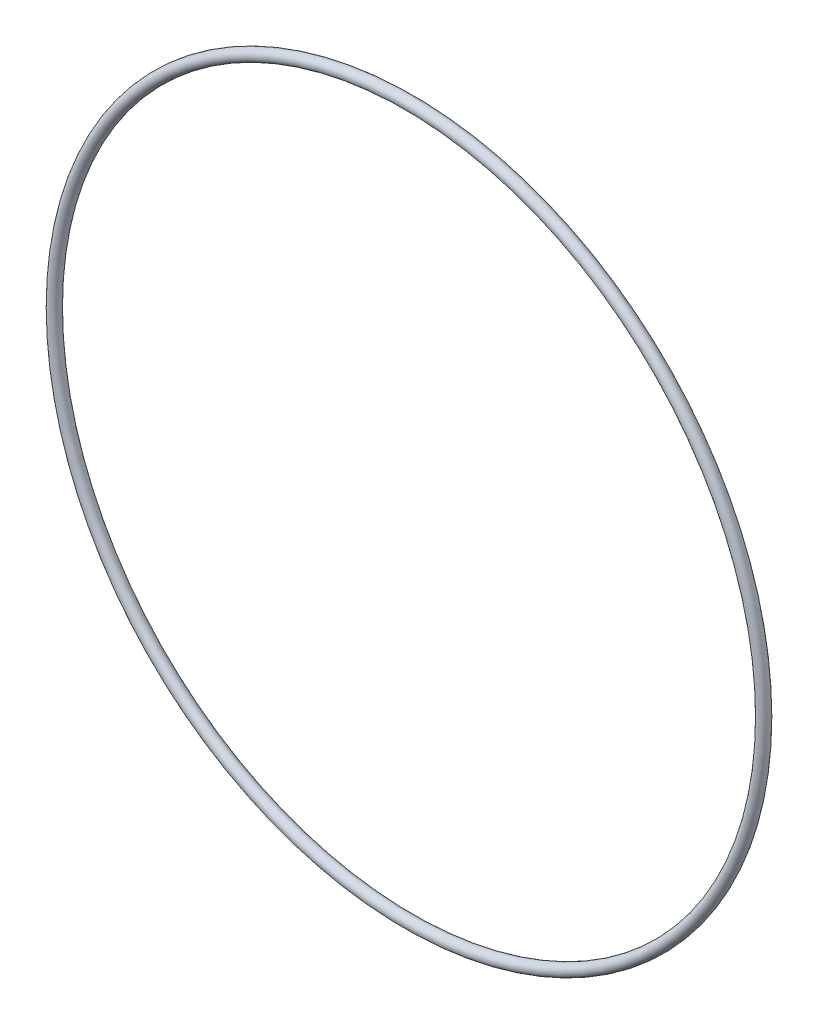
ISO-10303-21;
HEADER;
FILE_DESCRIPTION(('STEP AP214'),'2;1');
FILE_NAME('part.step','',(''),(''),'','','');
FILE_SCHEMA(('AUTOMOTIVE_DESIGN { 1 0 10303 214 1 1 1 1 }'));
ENDSEC;
DATA;
#1=APPLICATION_CONTEXT('core data for automotive mechanical design processes');
#2=APPLICATION_PROTOCOL_DEFINITION('international standard','automotive_design',2000,#1);
#3=PRODUCT_CONTEXT('',#1,'mechanical');
#4=PRODUCT('Part','Part','',(#3));
#5=PRODUCT_RELATED_PRODUCT_CATEGORY('part','',(#4));
#6=PRODUCT_DEFINITION_FORMATION('','',#4);
#7=PRODUCT_DEFINITION_CONTEXT('part definition',#1,'design');
#8=PRODUCT_DEFINITION('design','',#6,#7);
#9=PRODUCT_DEFINITION_SHAPE('','',#8);
#10=(LENGTH_UNIT() NAMED_UNIT(*) SI_UNIT(.MILLI.,.METRE.));
#11=(NAMED_UNIT(*) PLANE_ANGLE_UNIT() SI_UNIT($,.RADIAN.));
#12=(NAMED_UNIT(*) SI_UNIT($,.STERADIAN.) SOLID_ANGLE_UNIT());
#13=UNCERTAINTY_MEASURE_WITH_UNIT(LENGTH_MEASURE(1.E-05),#10,'distance_accuracy_value','');
#14=(GEOMETRIC_REPRESENTATION_CONTEXT(3) GLOBAL_UNCERTAINTY_ASSIGNED_CONTEXT((#13)) GLOBAL_UNIT_ASSIGNED_CONTEXT((#10,
#11,#12)) REPRESENTATION_CONTEXT('',''));
#15=CARTESIAN_POINT('',(0.,0.,0.));
#16=DIRECTION('',(0.,0.,1.));
#17=DIRECTION('',(1.,0.,0.));
#18=AXIS2_PLACEMENT_3D('',#15,#16,#17);
#19=CARTESIAN_POINT('',(0.,0.,0.));
#20=DIRECTION('',(0.,0.,1.));
#21=DIRECTION('',(1.,0.,0.));
#22=AXIS2_PLACEMENT_3D('',#19,#20,#21);
#23=TOROIDAL_SURFACE('',#22,54.7243,0.889000000000003);
#24=CARTESIAN_POINT('',(55.6133,0.,0.));
#25=VERTEX_POINT('',#24);
#26=VERTEX_LOOP('',#25);
#27=FACE_BOUND('',#26,.T.);
#28=ADVANCED_FACE('F33',(#27),#23,.T.);
#29=CLOSED_SHELL('',(#28));
#30=MANIFOLD_SOLID_BREP('B2',#29);
#31=ADVANCED_BREP_SHAPE_REPRESENTATION('',(#18,#30),#14);
#32=SHAPE_DEFINITION_REPRESENTATION(#9,#31);
ENDSEC;
END-ISO-10303-21;
